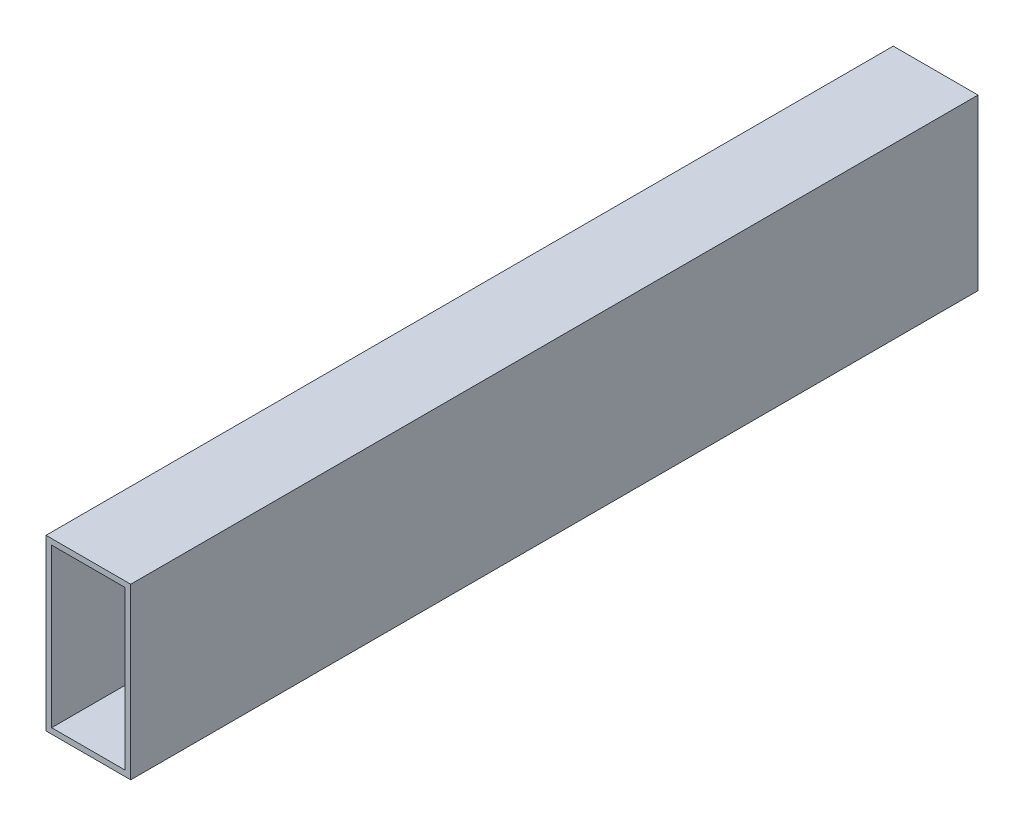
ISO-10303-21;
HEADER;
FILE_DESCRIPTION(('STEP AP214'),'2;1');
FILE_NAME('part.step','',(''),(''),'','','');
FILE_SCHEMA(('AUTOMOTIVE_DESIGN { 1 0 10303 214 1 1 1 1 }'));
ENDSEC;
DATA;
#1=APPLICATION_CONTEXT('core data for automotive mechanical design processes');
#2=APPLICATION_PROTOCOL_DEFINITION('international standard','automotive_design',2000,#1);
#3=PRODUCT_CONTEXT('',#1,'mechanical');
#4=PRODUCT('Part','Part','',(#3));
#5=PRODUCT_RELATED_PRODUCT_CATEGORY('part','',(#4));
#6=PRODUCT_DEFINITION_FORMATION('','',#4);
#7=PRODUCT_DEFINITION_CONTEXT('part definition',#1,'design');
#8=PRODUCT_DEFINITION('design','',#6,#7);
#9=PRODUCT_DEFINITION_SHAPE('','',#8);
#10=(LENGTH_UNIT() NAMED_UNIT(*) SI_UNIT(.MILLI.,.METRE.));
#11=(NAMED_UNIT(*) PLANE_ANGLE_UNIT() SI_UNIT($,.RADIAN.));
#12=(NAMED_UNIT(*) SI_UNIT($,.STERADIAN.) SOLID_ANGLE_UNIT());
#13=UNCERTAINTY_MEASURE_WITH_UNIT(LENGTH_MEASURE(1.E-05),#10,'distance_accuracy_value','');
#14=(GEOMETRIC_REPRESENTATION_CONTEXT(3) GLOBAL_UNCERTAINTY_ASSIGNED_CONTEXT((#13)) GLOBAL_UNIT_ASSIGNED_CONTEXT((#10,
#11,#12)) REPRESENTATION_CONTEXT('',''));
#15=CARTESIAN_POINT('',(0.,0.,0.));
#16=DIRECTION('',(0.,0.,1.));
#17=DIRECTION('',(1.,0.,0.));
#18=AXIS2_PLACEMENT_3D('',#15,#16,#17);
#19=CARTESIAN_POINT('',(-30.,60.,300.));
#20=DIRECTION('',(1.,0.,0.));
#21=DIRECTION('',(0.,0.,-1.));
#22=AXIS2_PLACEMENT_3D('',#19,#20,#21);
#23=PLANE('',#22);
#24=DIRECTION('',(0.,0.,-1.));
#25=VECTOR('',#24,1.);
#26=CARTESIAN_POINT('',(-30.,-60.,300.));
#27=LINE('',#26,#25);
#28=CARTESIAN_POINT('',(-30.,-60.,300.));
#29=VERTEX_POINT('',#28);
#30=CARTESIAN_POINT('',(-30.,-60.,-300.));
#31=VERTEX_POINT('',#30);
#32=EDGE_CURVE('E98',#29,#31,#27,.T.);
#33=ORIENTED_EDGE('',*,*,#32,.F.);
#34=DIRECTION('',(0.,-1.,0.));
#35=VECTOR('',#34,1.);
#36=CARTESIAN_POINT('',(-30.,60.,300.));
#37=LINE('',#36,#35);
#38=CARTESIAN_POINT('',(-30.,60.,300.));
#39=VERTEX_POINT('',#38);
#40=EDGE_CURVE('E87',#39,#29,#37,.T.);
#41=ORIENTED_EDGE('',*,*,#40,.F.);
#42=DIRECTION('',(0.,0.,-1.));
#43=VECTOR('',#42,1.);
#44=CARTESIAN_POINT('',(-30.,60.,300.));
#45=LINE('',#44,#43);
#46=CARTESIAN_POINT('',(-30.,60.,-300.));
#47=VERTEX_POINT('',#46);
#48=EDGE_CURVE('E103',#39,#47,#45,.T.);
#49=ORIENTED_EDGE('',*,*,#48,.T.);
#50=DIRECTION('',(0.,-1.,0.));
#51=VECTOR('',#50,1.);
#52=CARTESIAN_POINT('',(-30.,60.,-300.));
#53=LINE('',#52,#51);
#54=EDGE_CURVE('E99',#47,#31,#53,.T.);
#55=ORIENTED_EDGE('',*,*,#54,.T.);
#56=EDGE_LOOP('',(#33,#41,#49,#55));
#57=FACE_BOUND('',#56,.T.);
#58=ADVANCED_FACE('F35',(#57),#23,.F.);
#59=CARTESIAN_POINT('',(-30.,-60.,300.));
#60=DIRECTION('',(0.,1.,0.));
#61=DIRECTION('',(-1.,0.,0.));
#62=AXIS2_PLACEMENT_3D('',#59,#60,#61);
#63=PLANE('',#62);
#64=DIRECTION('',(0.,0.,-1.));
#65=VECTOR('',#64,1.);
#66=CARTESIAN_POINT('',(30.,-60.,300.));
#67=LINE('',#66,#65);
#68=CARTESIAN_POINT('',(30.,-60.,300.));
#69=VERTEX_POINT('',#68);
#70=CARTESIAN_POINT('',(30.,-60.,-300.));
#71=VERTEX_POINT('',#70);
#72=EDGE_CURVE('E102',#69,#71,#67,.T.);
#73=ORIENTED_EDGE('',*,*,#72,.F.);
#74=DIRECTION('',(1.,0.,0.));
#75=VECTOR('',#74,1.);
#76=CARTESIAN_POINT('',(-30.,-60.,300.));
#77=LINE('',#76,#75);
#78=EDGE_CURVE('E84',#29,#69,#77,.T.);
#79=ORIENTED_EDGE('',*,*,#78,.F.);
#80=ORIENTED_EDGE('',*,*,#32,.T.);
#81=DIRECTION('',(1.,0.,0.));
#82=VECTOR('',#81,1.);
#83=CARTESIAN_POINT('',(-30.,-60.,-300.));
#84=LINE('',#83,#82);
#85=EDGE_CURVE('E125',#31,#71,#84,.T.);
#86=ORIENTED_EDGE('',*,*,#85,.T.);
#87=EDGE_LOOP('',(#73,#79,#80,#86));
#88=FACE_BOUND('',#87,.T.);
#89=ADVANCED_FACE('F105',(#88),#63,.F.);
#90=CARTESIAN_POINT('',(30.,60.,300.));
#91=DIRECTION('',(-1.,0.,0.));
#92=DIRECTION('',(0.,-1.,0.));
#93=AXIS2_PLACEMENT_3D('',#90,#91,#92);
#94=PLANE('',#93);
#95=DIRECTION('',(0.,0.,-1.));
#96=VECTOR('',#95,1.);
#97=CARTESIAN_POINT('',(30.,60.,300.));
#98=LINE('',#97,#96);
#99=CARTESIAN_POINT('',(30.,60.,300.));
#100=VERTEX_POINT('',#99);
#101=CARTESIAN_POINT('',(30.,60.,-300.));
#102=VERTEX_POINT('',#101);
#103=EDGE_CURVE('E39',#100,#102,#98,.T.);
#104=ORIENTED_EDGE('',*,*,#103,.F.);
#105=DIRECTION('',(0.,1.,0.));
#106=VECTOR('',#105,1.);
#107=CARTESIAN_POINT('',(30.,60.,300.));
#108=LINE('',#107,#106);
#109=EDGE_CURVE('E108',#69,#100,#108,.T.);
#110=ORIENTED_EDGE('',*,*,#109,.F.);
#111=ORIENTED_EDGE('',*,*,#72,.T.);
#112=DIRECTION('',(0.,1.,0.));
#113=VECTOR('',#112,1.);
#114=CARTESIAN_POINT('',(30.,60.,-300.));
#115=LINE('',#114,#113);
#116=EDGE_CURVE('E112',#71,#102,#115,.T.);
#117=ORIENTED_EDGE('',*,*,#116,.T.);
#118=EDGE_LOOP('',(#104,#110,#111,#117));
#119=FACE_BOUND('',#118,.T.);
#120=ADVANCED_FACE('F123',(#119),#94,.F.);
#121=CARTESIAN_POINT('',(-30.,60.,300.));
#122=DIRECTION('',(0.,-1.,0.));
#123=DIRECTION('',(1.,0.,0.));
#124=AXIS2_PLACEMENT_3D('',#121,#122,#123);
#125=PLANE('',#124);
#126=DIRECTION('',(-1.,0.,0.));
#127=VECTOR('',#126,1.);
#128=CARTESIAN_POINT('',(-30.,60.,-300.));
#129=LINE('',#128,#127);
#130=EDGE_CURVE('E122',#102,#47,#129,.T.);
#131=ORIENTED_EDGE('',*,*,#130,.T.);
#132=ORIENTED_EDGE('',*,*,#48,.F.);
#133=DIRECTION('',(-1.,0.,0.));
#134=VECTOR('',#133,1.);
#135=CARTESIAN_POINT('',(-30.,60.,300.));
#136=LINE('',#135,#134);
#137=EDGE_CURVE('E91',#100,#39,#136,.T.);
#138=ORIENTED_EDGE('',*,*,#137,.F.);
#139=ORIENTED_EDGE('',*,*,#103,.T.);
#140=EDGE_LOOP('',(#131,#132,#138,#139));
#141=FACE_BOUND('',#140,.T.);
#142=ADVANCED_FACE('F37',(#141),#125,.F.);
#143=CARTESIAN_POINT('',(0.,0.,300.));
#144=DIRECTION('',(0.,0.,1.));
#145=DIRECTION('',(1.,0.,0.));
#146=AXIS2_PLACEMENT_3D('',#143,#144,#145);
#147=PLANE('',#146);
#148=DIRECTION('',(0.,-1.,0.));
#149=VECTOR('',#148,1.);
#150=CARTESIAN_POINT('',(-26.,56.,300.));
#151=LINE('',#150,#149);
#152=CARTESIAN_POINT('',(-26.,-56.,300.));
#153=VERTEX_POINT('',#152);
#154=CARTESIAN_POINT('',(-26.,56.,300.));
#155=VERTEX_POINT('',#154);
#156=EDGE_CURVE('E130',#153,#155,#151,.F.);
#157=ORIENTED_EDGE('',*,*,#156,.T.);
#158=DIRECTION('',(-1.,0.,0.));
#159=VECTOR('',#158,1.);
#160=CARTESIAN_POINT('',(-26.,56.,300.));
#161=LINE('',#160,#159);
#162=CARTESIAN_POINT('',(26.,56.,300.));
#163=VERTEX_POINT('',#162);
#164=EDGE_CURVE('E126',#155,#163,#161,.F.);
#165=ORIENTED_EDGE('',*,*,#164,.T.);
#166=DIRECTION('',(0.,1.,0.));
#167=VECTOR('',#166,1.);
#168=CARTESIAN_POINT('',(26.,56.,300.));
#169=LINE('',#168,#167);
#170=CARTESIAN_POINT('',(26.,-56.,300.));
#171=VERTEX_POINT('',#170);
#172=EDGE_CURVE('E144',#163,#171,#169,.F.);
#173=ORIENTED_EDGE('',*,*,#172,.T.);
#174=DIRECTION('',(1.,0.,0.));
#175=VECTOR('',#174,1.);
#176=CARTESIAN_POINT('',(-26.,-56.,300.));
#177=LINE('',#176,#175);
#178=EDGE_CURVE('E134',#171,#153,#177,.F.);
#179=ORIENTED_EDGE('',*,*,#178,.T.);
#180=EDGE_LOOP('',(#157,#165,#173,#179));
#181=FACE_BOUND('',#180,.T.);
#182=ORIENTED_EDGE('',*,*,#40,.T.);
#183=ORIENTED_EDGE('',*,*,#78,.T.);
#184=ORIENTED_EDGE('',*,*,#109,.T.);
#185=ORIENTED_EDGE('',*,*,#137,.T.);
#186=EDGE_LOOP('',(#182,#183,#184,#185));
#187=FACE_BOUND('',#186,.T.);
#188=ADVANCED_FACE('F89',(#181,#187),#147,.T.);
#189=CARTESIAN_POINT('',(0.,0.,-300.));
#190=DIRECTION('',(0.,0.,1.));
#191=DIRECTION('',(1.,0.,0.));
#192=AXIS2_PLACEMENT_3D('',#189,#190,#191);
#193=PLANE('',#192);
#194=DIRECTION('',(0.,-1.,0.));
#195=VECTOR('',#194,1.);
#196=CARTESIAN_POINT('',(-26.,56.,-300.));
#197=LINE('',#196,#195);
#198=CARTESIAN_POINT('',(-26.,-56.,-300.));
#199=VERTEX_POINT('',#198);
#200=CARTESIAN_POINT('',(-26.,56.,-300.));
#201=VERTEX_POINT('',#200);
#202=EDGE_CURVE('E11',#199,#201,#197,.F.);
#203=ORIENTED_EDGE('',*,*,#202,.F.);
#204=DIRECTION('',(1.,0.,0.));
#205=VECTOR('',#204,1.);
#206=CARTESIAN_POINT('',(-26.,-56.,-300.));
#207=LINE('',#206,#205);
#208=CARTESIAN_POINT('',(26.,-56.,-300.));
#209=VERTEX_POINT('',#208);
#210=EDGE_CURVE('E45',#209,#199,#207,.F.);
#211=ORIENTED_EDGE('',*,*,#210,.F.);
#212=DIRECTION('',(0.,1.,0.));
#213=VECTOR('',#212,1.);
#214=CARTESIAN_POINT('',(26.,56.,-300.));
#215=LINE('',#214,#213);
#216=CARTESIAN_POINT('',(26.,56.,-300.));
#217=VERTEX_POINT('',#216);
#218=EDGE_CURVE('E141',#217,#209,#215,.F.);
#219=ORIENTED_EDGE('',*,*,#218,.F.);
#220=DIRECTION('',(-1.,0.,0.));
#221=VECTOR('',#220,1.);
#222=CARTESIAN_POINT('',(-26.,56.,-300.));
#223=LINE('',#222,#221);
#224=EDGE_CURVE('E138',#201,#217,#223,.F.);
#225=ORIENTED_EDGE('',*,*,#224,.F.);
#226=EDGE_LOOP('',(#203,#211,#219,#225));
#227=FACE_BOUND('',#226,.T.);
#228=ORIENTED_EDGE('',*,*,#54,.F.);
#229=ORIENTED_EDGE('',*,*,#130,.F.);
#230=ORIENTED_EDGE('',*,*,#116,.F.);
#231=ORIENTED_EDGE('',*,*,#85,.F.);
#232=EDGE_LOOP('',(#228,#229,#230,#231));
#233=FACE_BOUND('',#232,.T.);
#234=ADVANCED_FACE('F191',(#227,#233),#193,.F.);
#235=CARTESIAN_POINT('',(-26.,56.,300.));
#236=DIRECTION('',(0.,1.,0.));
#237=DIRECTION('',(-1.,0.,0.));
#238=AXIS2_PLACEMENT_3D('',#235,#236,#237);
#239=PLANE('',#238);
#240=DIRECTION('',(0.,0.,-1.));
#241=VECTOR('',#240,1.);
#242=CARTESIAN_POINT('',(26.,56.,300.));
#243=LINE('',#242,#241);
#244=EDGE_CURVE('E146',#163,#217,#243,.T.);
#245=ORIENTED_EDGE('',*,*,#244,.F.);
#246=ORIENTED_EDGE('',*,*,#164,.F.);
#247=DIRECTION('',(0.,0.,-1.));
#248=VECTOR('',#247,1.);
#249=CARTESIAN_POINT('',(-26.,56.,300.));
#250=LINE('',#249,#248);
#251=EDGE_CURVE('E133',#155,#201,#250,.T.);
#252=ORIENTED_EDGE('',*,*,#251,.T.);
#253=ORIENTED_EDGE('',*,*,#224,.T.);
#254=EDGE_LOOP('',(#245,#246,#252,#253));
#255=FACE_BOUND('',#254,.T.);
#256=ADVANCED_FACE('F168',(#255),#239,.F.);
#257=CARTESIAN_POINT('',(26.,56.,300.));
#258=DIRECTION('',(1.,0.,0.));
#259=DIRECTION('',(0.,0.,-1.));
#260=AXIS2_PLACEMENT_3D('',#257,#258,#259);
#261=PLANE('',#260);
#262=DIRECTION('',(0.,0.,-1.));
#263=VECTOR('',#262,1.);
#264=CARTESIAN_POINT('',(26.,-56.,300.));
#265=LINE('',#264,#263);
#266=EDGE_CURVE('E139',#171,#209,#265,.T.);
#267=ORIENTED_EDGE('',*,*,#266,.F.);
#268=ORIENTED_EDGE('',*,*,#172,.F.);
#269=ORIENTED_EDGE('',*,*,#244,.T.);
#270=ORIENTED_EDGE('',*,*,#218,.T.);
#271=EDGE_LOOP('',(#267,#268,#269,#270));
#272=FACE_BOUND('',#271,.T.);
#273=ADVANCED_FACE('F172',(#272),#261,.F.);
#274=CARTESIAN_POINT('',(-26.,-56.,300.));
#275=DIRECTION('',(0.,-1.,0.));
#276=DIRECTION('',(1.,0.,0.));
#277=AXIS2_PLACEMENT_3D('',#274,#275,#276);
#278=PLANE('',#277);
#279=DIRECTION('',(0.,0.,-1.));
#280=VECTOR('',#279,1.);
#281=CARTESIAN_POINT('',(-26.,-56.,300.));
#282=LINE('',#281,#280);
#283=EDGE_CURVE('E135',#153,#199,#282,.T.);
#284=ORIENTED_EDGE('',*,*,#283,.F.);
#285=ORIENTED_EDGE('',*,*,#178,.F.);
#286=ORIENTED_EDGE('',*,*,#266,.T.);
#287=ORIENTED_EDGE('',*,*,#210,.T.);
#288=EDGE_LOOP('',(#284,#285,#286,#287));
#289=FACE_BOUND('',#288,.T.);
#290=ADVANCED_FACE('F180',(#289),#278,.F.);
#291=CARTESIAN_POINT('',(-26.,56.,300.));
#292=DIRECTION('',(-1.,0.,0.));
#293=DIRECTION('',(0.,0.,1.));
#294=AXIS2_PLACEMENT_3D('',#291,#292,#293);
#295=PLANE('',#294);
#296=ORIENTED_EDGE('',*,*,#202,.T.);
#297=ORIENTED_EDGE('',*,*,#251,.F.);
#298=ORIENTED_EDGE('',*,*,#156,.F.);
#299=ORIENTED_EDGE('',*,*,#283,.T.);
#300=EDGE_LOOP('',(#296,#297,#298,#299));
#301=FACE_BOUND('',#300,.T.);
#302=ADVANCED_FACE('F179',(#301),#295,.F.);
#303=CLOSED_SHELL('',(#58,#89,#120,#142,#188,#234,#256,#273,#290,#302));
#304=MANIFOLD_SOLID_BREP('B2',#303);
#305=ADVANCED_BREP_SHAPE_REPRESENTATION('',(#18,#304),#14);
#306=SHAPE_DEFINITION_REPRESENTATION(#9,#305);
ENDSEC;
END-ISO-10303-21;
